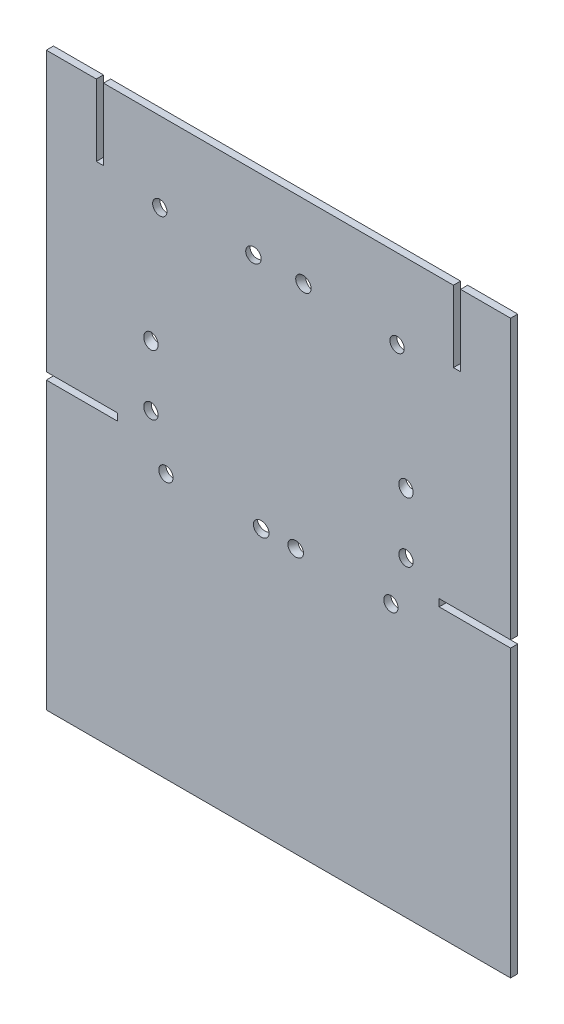
ISO-10303-21;
HEADER;
FILE_DESCRIPTION(('STEP AP214'),'2;1');
FILE_NAME('part.step','',(''),(''),'','','');
FILE_SCHEMA(('AUTOMOTIVE_DESIGN { 1 0 10303 214 1 1 1 1 }'));
ENDSEC;
DATA;
#1=APPLICATION_CONTEXT('core data for automotive mechanical design processes');
#2=APPLICATION_PROTOCOL_DEFINITION('international standard','automotive_design',2000,#1);
#3=PRODUCT_CONTEXT('',#1,'mechanical');
#4=PRODUCT('Part','Part','',(#3));
#5=PRODUCT_RELATED_PRODUCT_CATEGORY('part','',(#4));
#6=PRODUCT_DEFINITION_FORMATION('','',#4);
#7=PRODUCT_DEFINITION_CONTEXT('part definition',#1,'design');
#8=PRODUCT_DEFINITION('design','',#6,#7);
#9=PRODUCT_DEFINITION_SHAPE('','',#8);
#10=(LENGTH_UNIT() NAMED_UNIT(*) SI_UNIT(.MILLI.,.METRE.));
#11=(NAMED_UNIT(*) PLANE_ANGLE_UNIT() SI_UNIT($,.RADIAN.));
#12=(NAMED_UNIT(*) SI_UNIT($,.STERADIAN.) SOLID_ANGLE_UNIT());
#13=UNCERTAINTY_MEASURE_WITH_UNIT(LENGTH_MEASURE(1.E-05),#10,'distance_accuracy_value','');
#14=(GEOMETRIC_REPRESENTATION_CONTEXT(3) GLOBAL_UNCERTAINTY_ASSIGNED_CONTEXT((#13)) GLOBAL_UNIT_ASSIGNED_CONTEXT((#10,
#11,#12)) REPRESENTATION_CONTEXT('',''));
#15=CARTESIAN_POINT('',(0.,0.,0.));
#16=DIRECTION('',(0.,0.,1.));
#17=DIRECTION('',(1.,0.,0.));
#18=AXIS2_PLACEMENT_3D('',#15,#16,#17);
#19=CARTESIAN_POINT('',(-412.75,508.,6.35));
#20=DIRECTION('',(0.,-1.,0.));
#21=DIRECTION('',(1.,0.,0.));
#22=AXIS2_PLACEMENT_3D('',#19,#20,#21);
#23=PLANE('',#22);
#24=DIRECTION('',(-1.,0.,0.));
#25=VECTOR('',#24,1.);
#26=CARTESIAN_POINT('',(-412.75,508.,-6.35));
#27=LINE('',#26,#25);
#28=CARTESIAN_POINT('',(311.150000000003,507.999999999998,-6.35));
#29=VERTEX_POINT('',#28);
#30=CARTESIAN_POINT('',(-311.15,508.,-6.35));
#31=VERTEX_POINT('',#30);
#32=EDGE_CURVE('E349',#29,#31,#27,.T.);
#33=ORIENTED_EDGE('',*,*,#32,.T.);
#34=DIRECTION('',(0.,0.,-1.));
#35=VECTOR('',#34,1.);
#36=CARTESIAN_POINT('',(-311.15,508.,6.35000000000002));
#37=LINE('',#36,#35);
#38=CARTESIAN_POINT('',(-311.15,508.,6.35000000000002));
#39=VERTEX_POINT('',#38);
#40=EDGE_CURVE('E211',#39,#31,#37,.T.);
#41=ORIENTED_EDGE('',*,*,#40,.F.);
#42=DIRECTION('',(-1.,0.,0.));
#43=VECTOR('',#42,1.);
#44=CARTESIAN_POINT('',(-412.75,508.,6.35));
#45=LINE('',#44,#43);
#46=CARTESIAN_POINT('',(311.150000000003,507.999999999998,6.35000000000002));
#47=VERTEX_POINT('',#46);
#48=EDGE_CURVE('E202',#47,#39,#45,.T.);
#49=ORIENTED_EDGE('',*,*,#48,.F.);
#50=DIRECTION('',(0.,0.,-1.));
#51=VECTOR('',#50,1.);
#52=CARTESIAN_POINT('',(311.150000000003,507.999999999998,6.35000000000002));
#53=LINE('',#52,#51);
#54=EDGE_CURVE('E217',#47,#29,#53,.T.);
#55=ORIENTED_EDGE('',*,*,#54,.T.);
#56=EDGE_LOOP('',(#33,#41,#49,#55));
#57=FACE_BOUND('',#56,.T.);
#58=ADVANCED_FACE('F39',(#57),#23,.F.);
#59=CARTESIAN_POINT('',(-323.85,508.,6.35000000000002));
#60=VERTEX_POINT('',#59);
#61=CARTESIAN_POINT('',(-412.75,508.,6.35));
#62=VERTEX_POINT('',#61);
#63=EDGE_CURVE('E360',#60,#62,#45,.T.);
#64=ORIENTED_EDGE('',*,*,#63,.F.);
#65=DIRECTION('',(0.,0.,-1.));
#66=VECTOR('',#65,1.);
#67=CARTESIAN_POINT('',(-323.85,508.,6.35000000000002));
#68=LINE('',#67,#66);
#69=CARTESIAN_POINT('',(-323.85,508.,-6.35));
#70=VERTEX_POINT('',#69);
#71=EDGE_CURVE('E214',#60,#70,#68,.T.);
#72=ORIENTED_EDGE('',*,*,#71,.T.);
#73=CARTESIAN_POINT('',(-412.75,508.,-6.35));
#74=VERTEX_POINT('',#73);
#75=EDGE_CURVE('E342',#70,#74,#27,.T.);
#76=ORIENTED_EDGE('',*,*,#75,.T.);
#77=DIRECTION('',(0.,0.,-1.));
#78=VECTOR('',#77,1.);
#79=CARTESIAN_POINT('',(-412.75,508.,6.35));
#80=LINE('',#79,#78);
#81=EDGE_CURVE('E331',#62,#74,#80,.T.);
#82=ORIENTED_EDGE('',*,*,#81,.F.);
#83=EDGE_LOOP('',(#64,#72,#76,#82));
#84=FACE_BOUND('',#83,.T.);
#85=ADVANCED_FACE('F489',(#84),#23,.F.);
#86=CARTESIAN_POINT('',(412.75,508.,6.35));
#87=DIRECTION('',(-1.,0.,0.));
#88=DIRECTION('',(0.,-1.,0.));
#89=AXIS2_PLACEMENT_3D('',#86,#87,#88);
#90=PLANE('',#89);
#91=DIRECTION('',(0.,0.,-1.));
#92=VECTOR('',#91,1.);
#93=CARTESIAN_POINT('',(412.75,12.6999999999955,6.35000000000002));
#94=LINE('',#93,#92);
#95=CARTESIAN_POINT('',(412.75,12.6999999999955,6.35000000000002));
#96=VERTEX_POINT('',#95);
#97=CARTESIAN_POINT('',(412.75,12.6999999999955,-6.35));
#98=VERTEX_POINT('',#97);
#99=EDGE_CURVE('E213',#96,#98,#94,.T.);
#100=ORIENTED_EDGE('',*,*,#99,.T.);
#101=DIRECTION('',(0.,1.,0.));
#102=VECTOR('',#101,1.);
#103=CARTESIAN_POINT('',(412.75,508.,-6.35));
#104=LINE('',#103,#102);
#105=CARTESIAN_POINT('',(412.75,508.,-6.35));
#106=VERTEX_POINT('',#105);
#107=EDGE_CURVE('E266',#98,#106,#104,.T.);
#108=ORIENTED_EDGE('',*,*,#107,.T.);
#109=DIRECTION('',(0.,0.,-1.));
#110=VECTOR('',#109,1.);
#111=CARTESIAN_POINT('',(412.75,508.,6.35));
#112=LINE('',#111,#110);
#113=CARTESIAN_POINT('',(412.75,508.,6.35));
#114=VERTEX_POINT('',#113);
#115=EDGE_CURVE('E326',#114,#106,#112,.T.);
#116=ORIENTED_EDGE('',*,*,#115,.F.);
#117=DIRECTION('',(0.,1.,0.));
#118=VECTOR('',#117,1.);
#119=CARTESIAN_POINT('',(412.75,508.,6.35));
#120=LINE('',#119,#118);
#121=EDGE_CURVE('E364',#96,#114,#120,.T.);
#122=ORIENTED_EDGE('',*,*,#121,.F.);
#123=EDGE_LOOP('',(#100,#108,#116,#122));
#124=FACE_BOUND('',#123,.T.);
#125=ADVANCED_FACE('F448',(#124),#90,.F.);
#126=CARTESIAN_POINT('',(-412.75,508.,6.35));
#127=DIRECTION('',(1.,0.,0.));
#128=DIRECTION('',(0.,1.,0.));
#129=AXIS2_PLACEMENT_3D('',#126,#127,#128);
#130=PLANE('',#129);
#131=DIRECTION('',(0.,0.,-1.));
#132=VECTOR('',#131,1.);
#133=CARTESIAN_POINT('',(-412.75,2.22044604925031E-13,6.35000000000002));
#134=LINE('',#133,#132);
#135=CARTESIAN_POINT('',(-412.75,2.22044604925031E-13,6.35000000000002));
#136=VERTEX_POINT('',#135);
#137=CARTESIAN_POINT('',(-412.75,2.22044604925031E-13,-6.35));
#138=VERTEX_POINT('',#137);
#139=EDGE_CURVE('E263',#136,#138,#134,.T.);
#140=ORIENTED_EDGE('',*,*,#139,.T.);
#141=DIRECTION('',(0.,-1.,0.));
#142=VECTOR('',#141,1.);
#143=CARTESIAN_POINT('',(-412.75,508.,-6.35));
#144=LINE('',#143,#142);
#145=CARTESIAN_POINT('',(-412.75,-508.,-6.35));
#146=VERTEX_POINT('',#145);
#147=EDGE_CURVE('E329',#138,#146,#144,.T.);
#148=ORIENTED_EDGE('',*,*,#147,.T.);
#149=DIRECTION('',(0.,0.,-1.));
#150=VECTOR('',#149,1.);
#151=CARTESIAN_POINT('',(-412.75,-508.,6.35));
#152=LINE('',#151,#150);
#153=CARTESIAN_POINT('',(-412.75,-508.,6.35));
#154=VERTEX_POINT('',#153);
#155=EDGE_CURVE('E336',#154,#146,#152,.T.);
#156=ORIENTED_EDGE('',*,*,#155,.F.);
#157=DIRECTION('',(0.,-1.,0.));
#158=VECTOR('',#157,1.);
#159=CARTESIAN_POINT('',(-412.75,508.,6.35));
#160=LINE('',#159,#158);
#161=EDGE_CURVE('E356',#136,#154,#160,.T.);
#162=ORIENTED_EDGE('',*,*,#161,.F.);
#163=EDGE_LOOP('',(#140,#148,#156,#162));
#164=FACE_BOUND('',#163,.T.);
#165=ADVANCED_FACE('F474',(#164),#130,.F.);
#166=CARTESIAN_POINT('',(0.,0.,6.35));
#167=DIRECTION('',(0.,0.,1.));
#168=DIRECTION('',(1.,0.,0.));
#169=AXIS2_PLACEMENT_3D('',#166,#167,#168);
#170=PLANE('',#169);
#171=DIRECTION('',(0.,-1.,0.));
#172=VECTOR('',#171,1.);
#173=CARTESIAN_POINT('',(-311.15,508.,6.35000000000002));
#174=LINE('',#173,#172);
#175=CARTESIAN_POINT('',(-311.15,381.,6.35000000000002));
#176=VERTEX_POINT('',#175);
#177=EDGE_CURVE('E181',#39,#176,#174,.T.);
#178=ORIENTED_EDGE('',*,*,#177,.T.);
#179=DIRECTION('',(-1.,0.,0.));
#180=VECTOR('',#179,1.);
#181=CARTESIAN_POINT('',(-311.15,381.,6.35000000000002));
#182=LINE('',#181,#180);
#183=CARTESIAN_POINT('',(-323.85,381.,6.35000000000002));
#184=VERTEX_POINT('',#183);
#185=EDGE_CURVE('E192',#176,#184,#182,.T.);
#186=ORIENTED_EDGE('',*,*,#185,.T.);
#187=DIRECTION('',(0.,1.,0.));
#188=VECTOR('',#187,1.);
#189=CARTESIAN_POINT('',(-323.85,508.,6.35000000000002));
#190=LINE('',#189,#188);
#191=EDGE_CURVE('E189',#184,#60,#190,.T.);
#192=ORIENTED_EDGE('',*,*,#191,.T.);
#193=ORIENTED_EDGE('',*,*,#63,.T.);
#194=CARTESIAN_POINT('',(-412.75,12.6999999999982,6.35000000000002));
#195=VERTEX_POINT('',#194);
#196=EDGE_CURVE('E353',#62,#195,#160,.T.);
#197=ORIENTED_EDGE('',*,*,#196,.T.);
#198=DIRECTION('',(1.,0.,0.));
#199=VECTOR('',#198,1.);
#200=CARTESIAN_POINT('',(-412.75,12.6999999999982,6.35000000000002));
#201=LINE('',#200,#199);
#202=CARTESIAN_POINT('',(-285.75,12.6999999999982,6.35000000000002));
#203=VERTEX_POINT('',#202);
#204=EDGE_CURVE('E245',#195,#203,#201,.T.);
#205=ORIENTED_EDGE('',*,*,#204,.T.);
#206=DIRECTION('',(0.,-1.,0.));
#207=VECTOR('',#206,1.);
#208=CARTESIAN_POINT('',(-285.75,12.6999999999982,6.35000000000002));
#209=LINE('',#208,#207);
#210=CARTESIAN_POINT('',(-285.75,0.,6.35000000000002));
#211=VERTEX_POINT('',#210);
#212=EDGE_CURVE('E241',#203,#211,#209,.T.);
#213=ORIENTED_EDGE('',*,*,#212,.T.);
#214=DIRECTION('',(1.,0.,0.));
#215=VECTOR('',#214,1.);
#216=CARTESIAN_POINT('',(-412.75,2.22044604925031E-13,6.35000000000002));
#217=LINE('',#216,#215);
#218=EDGE_CURVE('E239',#136,#211,#217,.T.);
#219=ORIENTED_EDGE('',*,*,#218,.F.);
#220=ORIENTED_EDGE('',*,*,#161,.T.);
#221=DIRECTION('',(1.,0.,0.));
#222=VECTOR('',#221,1.);
#223=CARTESIAN_POINT('',(-412.75,-508.,6.35));
#224=LINE('',#223,#222);
#225=CARTESIAN_POINT('',(412.75,-508.,6.35));
#226=VERTEX_POINT('',#225);
#227=EDGE_CURVE('E325',#154,#226,#224,.T.);
#228=ORIENTED_EDGE('',*,*,#227,.T.);
#229=CARTESIAN_POINT('',(412.75,-2.66453525910038E-12,6.35000000000002));
#230=VERTEX_POINT('',#229);
#231=EDGE_CURVE('E361',#226,#230,#120,.T.);
#232=ORIENTED_EDGE('',*,*,#231,.T.);
#233=DIRECTION('',(-1.,0.,0.));
#234=VECTOR('',#233,1.);
#235=CARTESIAN_POINT('',(412.75,-2.66453525910038E-12,6.35000000000002));
#236=LINE('',#235,#234);
#237=CARTESIAN_POINT('',(285.75,-2.01395445867445E-12,6.35000000000002));
#238=VERTEX_POINT('',#237);
#239=EDGE_CURVE('E280',#230,#238,#236,.T.);
#240=ORIENTED_EDGE('',*,*,#239,.T.);
#241=DIRECTION('',(0.,-1.,0.));
#242=VECTOR('',#241,1.);
#243=CARTESIAN_POINT('',(285.75,12.6999999999964,6.35000000000002));
#244=LINE('',#243,#242);
#245=CARTESIAN_POINT('',(285.75,12.6999999999964,6.35000000000002));
#246=VERTEX_POINT('',#245);
#247=EDGE_CURVE('E286',#246,#238,#244,.T.);
#248=ORIENTED_EDGE('',*,*,#247,.F.);
#249=DIRECTION('',(-1.,0.,0.));
#250=VECTOR('',#249,1.);
#251=CARTESIAN_POINT('',(412.75,12.6999999999955,6.35000000000002));
#252=LINE('',#251,#250);
#253=EDGE_CURVE('E269',#96,#246,#252,.T.);
#254=ORIENTED_EDGE('',*,*,#253,.F.);
#255=ORIENTED_EDGE('',*,*,#121,.T.);
#256=CARTESIAN_POINT('',(323.850000000003,508.,6.35));
#257=VERTEX_POINT('',#256);
#258=EDGE_CURVE('E357',#114,#257,#45,.T.);
#259=ORIENTED_EDGE('',*,*,#258,.T.);
#260=DIRECTION('',(0.,-1.,0.));
#261=VECTOR('',#260,1.);
#262=CARTESIAN_POINT('',(323.850000000003,507.999999999998,6.35000000000002));
#263=LINE('',#262,#261);
#264=CARTESIAN_POINT('',(323.850000000003,380.999999999998,6.35000000000002));
#265=VERTEX_POINT('',#264);
#266=EDGE_CURVE('E56',#257,#265,#263,.T.);
#267=ORIENTED_EDGE('',*,*,#266,.T.);
#268=DIRECTION('',(-1.,0.,0.));
#269=VECTOR('',#268,1.);
#270=CARTESIAN_POINT('',(311.150000000003,380.999999999998,6.35000000000002));
#271=LINE('',#270,#269);
#272=CARTESIAN_POINT('',(311.150000000003,380.999999999998,6.35000000000002));
#273=VERTEX_POINT('',#272);
#274=EDGE_CURVE('E220',#265,#273,#271,.T.);
#275=ORIENTED_EDGE('',*,*,#274,.T.);
#276=DIRECTION('',(0.,1.,0.));
#277=VECTOR('',#276,1.);
#278=CARTESIAN_POINT('',(311.150000000003,507.999999999998,6.35000000000002));
#279=LINE('',#278,#277);
#280=EDGE_CURVE('E231',#273,#47,#279,.T.);
#281=ORIENTED_EDGE('',*,*,#280,.T.);
#282=ORIENTED_EDGE('',*,*,#48,.T.);
#283=EDGE_LOOP('',(#178,#186,#192,#193,#197,#205,#213,#219,#220,#228,#232,#240,#248,#254,#255,
#259,#267,#275,#281,#282));
#284=FACE_BOUND('',#283,.T.);
#285=CARTESIAN_POINT('',(-200.,-38.0999999999997,6.34999999999997));
#286=DIRECTION('',(0.,0.,1.));
#287=DIRECTION('',(1.,0.,0.));
#288=AXIS2_PLACEMENT_3D('',#285,#286,#287);
#289=CIRCLE('',#288,12.7);
#290=CARTESIAN_POINT('',(-187.3,-38.0999999999997,6.34999999999997));
#291=VERTEX_POINT('',#290);
#292=EDGE_CURVE('E43',#291,#291,#289,.F.);
#293=ORIENTED_EDGE('',*,*,#292,.T.);
#294=EDGE_LOOP('',(#293));
#295=FACE_BOUND('',#294,.T.);
#296=CARTESIAN_POINT('',(-226.738278646609,45.742927735187,6.35000000000002));
#297=DIRECTION('',(0.,0.,1.));
#298=DIRECTION('',(-0.303832853142546,0.95272535252887,0.));
#299=AXIS2_PLACEMENT_3D('',#296,#297,#298);
#300=ELLIPSE('',#299,13.0343806943275,12.7);
#301=CARTESIAN_POINT('',(-230.698551721913,58.1611126771857,6.35000000000002));
#302=VERTEX_POINT('',#301);
#303=EDGE_CURVE('E303',#302,#302,#300,.F.);
#304=ORIENTED_EDGE('',*,*,#303,.T.);
#305=EDGE_LOOP('',(#304));
#306=FACE_BOUND('',#305,.T.);
#307=CARTESIAN_POINT('',(200.000000000002,-38.0999999999998,6.35000000000002));
#308=DIRECTION('',(0.,0.,1.));
#309=DIRECTION('',(1.,0.,0.));
#310=AXIS2_PLACEMENT_3D('',#307,#308,#309);
#311=CIRCLE('',#310,12.7);
#312=CARTESIAN_POINT('',(212.700000000002,-38.0999999999998,6.35000000000002));
#313=VERTEX_POINT('',#312);
#314=EDGE_CURVE('E300',#313,#313,#311,.F.);
#315=ORIENTED_EDGE('',*,*,#314,.T.);
#316=EDGE_LOOP('',(#315));
#317=FACE_BOUND('',#316,.T.);
#318=CARTESIAN_POINT('',(226.738278646599,45.742927735198,6.35000000000002));
#319=DIRECTION('',(0.,0.,1.));
#320=DIRECTION('',(0.303832853142368,0.952725352528927,0.));
#321=AXIS2_PLACEMENT_3D('',#318,#319,#320);
#322=ELLIPSE('',#321,13.0343806943275,12.7);
#323=CARTESIAN_POINT('',(230.6985517219,58.1611126771975,6.35000000000002));
#324=VERTEX_POINT('',#323);
#325=EDGE_CURVE('E297',#324,#324,#322,.F.);
#326=ORIENTED_EDGE('',*,*,#325,.T.);
#327=EDGE_LOOP('',(#326));
#328=FACE_BOUND('',#327,.T.);
#329=CARTESIAN_POINT('',(210.931171426476,366.455479351303,6.35000000000002));
#330=DIRECTION('',(0.,0.,1.));
#331=DIRECTION('',(0.196463058124641,0.980511227264795,0.));
#332=AXIS2_PLACEMENT_3D('',#329,#330,#331);
#333=ELLIPSE('',#332,12.8347094862159,12.7);
#334=CARTESIAN_POINT('',(213.452717702279,379.04005610122,6.35000000000002));
#335=VERTEX_POINT('',#334);
#336=EDGE_CURVE('E294',#335,#335,#333,.F.);
#337=ORIENTED_EDGE('',*,*,#336,.T.);
#338=EDGE_LOOP('',(#337));
#339=FACE_BOUND('',#338,.T.);
#340=CARTESIAN_POINT('',(-210.931171426473,366.455479351302,6.34999999999997));
#341=DIRECTION('',(0.,0.,1.));
#342=DIRECTION('',(0.19646305812471,-0.980511227264781,0.));
#343=AXIS2_PLACEMENT_3D('',#340,#341,#342);
#344=ELLIPSE('',#343,12.8347094862159,12.7);
#345=CARTESIAN_POINT('',(-208.409625150669,353.870902601385,6.34999999999997));
#346=VERTEX_POINT('',#345);
#347=EDGE_CURVE('E290',#346,#346,#344,.F.);
#348=ORIENTED_EDGE('',*,*,#347,.T.);
#349=EDGE_LOOP('',(#348));
#350=FACE_BOUND('',#349,.T.);
#351=CARTESIAN_POINT('',(226.738278646599,153.183977553133,6.35000000000002));
#352=DIRECTION('',(0.,0.,1.));
#353=DIRECTION('',(0.166125263951469,-0.98610465807492,0.));
#354=AXIS2_PLACEMENT_3D('',#351,#352,#353);
#355=ELLIPSE('',#354,13.7867372389529,12.7);
#356=CARTESIAN_POINT('',(229.028604009449,139.588811742146,6.35000000000002));
#357=VERTEX_POINT('',#356);
#358=EDGE_CURVE('E293',#357,#357,#355,.F.);
#359=ORIENTED_EDGE('',*,*,#358,.T.);
#360=EDGE_LOOP('',(#359));
#361=FACE_BOUND('',#360,.T.);
#362=CARTESIAN_POINT('',(-226.738278646608,153.183977553121,6.35000000000002));
#363=DIRECTION('',(0.,0.,1.));
#364=DIRECTION('',(-0.166125263951556,-0.986104658074905,0.));
#365=AXIS2_PLACEMENT_3D('',#362,#363,#364);
#366=ELLIPSE('',#365,13.7867372389531,12.7);
#367=CARTESIAN_POINT('',(-229.02860400946,139.588811742135,6.35000000000002));
#368=VERTEX_POINT('',#367);
#369=EDGE_CURVE('E367',#368,#368,#366,.F.);
#370=ORIENTED_EDGE('',*,*,#369,.T.);
#371=EDGE_LOOP('',(#370));
#372=FACE_BOUND('',#371,.T.);
#373=CARTESIAN_POINT('',(-44.4461666666638,376.690974591494,6.35000000000002));
#374=DIRECTION('',(0.,0.,1.));
#375=DIRECTION('',(0.923125632822931,0.384498460367872,0.));
#376=AXIS2_PLACEMENT_3D('',#373,#374,#375);
#377=ELLIPSE('',#376,13.8866788867449,12.7);
#378=CARTESIAN_POINT('',(-31.6270174315286,382.03038124307,6.35000000000002));
#379=VERTEX_POINT('',#378);
#380=EDGE_CURVE('E370',#379,#379,#377,.F.);
#381=ORIENTED_EDGE('',*,*,#380,.T.);
#382=EDGE_LOOP('',(#381));
#383=FACE_BOUND('',#382,.T.);
#384=CARTESIAN_POINT('',(44.446166666669,376.690974591494,6.34999999999997));
#385=DIRECTION('',(0.,0.,1.));
#386=DIRECTION('',(0.923125632822932,-0.384498460367868,0.));
#387=AXIS2_PLACEMENT_3D('',#384,#385,#386);
#388=ELLIPSE('',#387,13.8866788867449,12.7);
#389=CARTESIAN_POINT('',(57.2653159018043,371.351567939917,6.34999999999997));
#390=VERTEX_POINT('',#389);
#391=EDGE_CURVE('E373',#390,#390,#388,.F.);
#392=ORIENTED_EDGE('',*,*,#391,.T.);
#393=EDGE_LOOP('',(#392));
#394=FACE_BOUND('',#393,.T.);
#395=CARTESIAN_POINT('',(-30.6666666666667,-38.0999999999998,6.35000000000002));
#396=DIRECTION('',(0.,0.,1.));
#397=DIRECTION('',(1.,0.,0.));
#398=AXIS2_PLACEMENT_3D('',#395,#396,#397);
#399=ELLIPSE('',#398,13.8978326758678,12.7);
#400=CARTESIAN_POINT('',(-16.7688339907989,-38.0999999999998,6.35000000000002));
#401=VERTEX_POINT('',#400);
#402=EDGE_CURVE('E376',#401,#401,#399,.F.);
#403=ORIENTED_EDGE('',*,*,#402,.T.);
#404=EDGE_LOOP('',(#403));
#405=FACE_BOUND('',#404,.T.);
#406=CARTESIAN_POINT('',(30.6666666666675,-38.0999999999997,6.34999999999997));
#407=DIRECTION('',(0.,0.,1.));
#408=DIRECTION('',(1.,0.,0.));
#409=AXIS2_PLACEMENT_3D('',#406,#407,#408);
#410=ELLIPSE('',#409,13.8978326758679,12.7);
#411=CARTESIAN_POINT('',(44.5644993425353,-38.0999999999997,6.34999999999997));
#412=VERTEX_POINT('',#411);
#413=EDGE_CURVE('E379',#412,#412,#410,.F.);
#414=ORIENTED_EDGE('',*,*,#413,.T.);
#415=EDGE_LOOP('',(#414));
#416=FACE_BOUND('',#415,.T.);
#417=ADVANCED_FACE('F41',(#284,#295,#306,#317,#328,#339,#350,#361,#372,#383,#394,#405,#416),
#170,.T.);
#418=CARTESIAN_POINT('',(0.,0.,-6.35));
#419=DIRECTION('',(0.,0.,1.));
#420=DIRECTION('',(1.,0.,0.));
#421=AXIS2_PLACEMENT_3D('',#418,#419,#420);
#422=PLANE('',#421);
#423=CARTESIAN_POINT('',(-200.,-38.0999999999997,-6.34999999999997));
#424=DIRECTION('',(0.,0.,1.));
#425=DIRECTION('',(1.,0.,0.));
#426=AXIS2_PLACEMENT_3D('',#423,#424,#425);
#427=CIRCLE('',#426,12.7);
#428=CARTESIAN_POINT('',(-187.3,-38.0999999999997,-6.34999999999997));
#429=VERTEX_POINT('',#428);
#430=EDGE_CURVE('E11',#429,#429,#427,.F.);
#431=ORIENTED_EDGE('',*,*,#430,.F.);
#432=EDGE_LOOP('',(#431));
#433=FACE_BOUND('',#432,.T.);
#434=CARTESIAN_POINT('',(-225.847002691722,42.9481634773474,-6.35000000000002));
#435=DIRECTION('',(0.,0.,1.));
#436=DIRECTION('',(-0.303832853142546,0.95272535252887,0.));
#437=AXIS2_PLACEMENT_3D('',#434,#435,#436);
#438=ELLIPSE('',#437,13.0343806943275,12.7);
#439=CARTESIAN_POINT('',(-229.807275767026,55.3663484193461,-6.35000000000002));
#440=VERTEX_POINT('',#439);
#441=EDGE_CURVE('E48',#440,#440,#438,.F.);
#442=ORIENTED_EDGE('',*,*,#441,.F.);
#443=EDGE_LOOP('',(#442));
#444=FACE_BOUND('',#443,.T.);
#445=CARTESIAN_POINT('',(200.000000000002,-38.0999999999998,-6.35000000000002));
#446=DIRECTION('',(0.,0.,1.));
#447=DIRECTION('',(1.,0.,0.));
#448=AXIS2_PLACEMENT_3D('',#445,#446,#447);
#449=CIRCLE('',#448,12.7);
#450=CARTESIAN_POINT('',(212.700000000002,-38.0999999999998,-6.35000000000002));
#451=VERTEX_POINT('',#450);
#452=EDGE_CURVE('E390',#451,#451,#449,.F.);
#453=ORIENTED_EDGE('',*,*,#452,.F.);
#454=EDGE_LOOP('',(#453));
#455=FACE_BOUND('',#454,.T.);
#456=CARTESIAN_POINT('',(225.847002691712,42.9481634773581,-6.35000000000002));
#457=DIRECTION('',(0.,0.,1.));
#458=DIRECTION('',(0.303832853142368,0.952725352528927,0.));
#459=AXIS2_PLACEMENT_3D('',#456,#457,#458);
#460=ELLIPSE('',#459,13.0343806943275,12.7);
#461=CARTESIAN_POINT('',(229.807275767014,55.3663484193575,-6.35000000000002));
#462=VERTEX_POINT('',#461);
#463=EDGE_CURVE('E387',#462,#462,#460,.F.);
#464=ORIENTED_EDGE('',*,*,#463,.F.);
#465=EDGE_LOOP('',(#464));
#466=FACE_BOUND('',#465,.T.);
#467=CARTESIAN_POINT('',(210.566799045594,364.636963372926,-6.35000000000002));
#468=DIRECTION('',(0.,0.,1.));
#469=DIRECTION('',(0.196463058124641,0.980511227264795,0.));
#470=AXIS2_PLACEMENT_3D('',#467,#468,#469);
#471=ELLIPSE('',#470,12.8347094862159,12.7);
#472=CARTESIAN_POINT('',(213.088345321397,377.221540122843,-6.35000000000002));
#473=VERTEX_POINT('',#472);
#474=EDGE_CURVE('E384',#473,#473,#471,.F.);
#475=ORIENTED_EDGE('',*,*,#474,.F.);
#476=EDGE_LOOP('',(#475));
#477=FACE_BOUND('',#476,.T.);
#478=CARTESIAN_POINT('',(-210.56679904559,364.636963372925,-6.34999999999997));
#479=DIRECTION('',(0.,0.,1.));
#480=DIRECTION('',(0.19646305812471,-0.980511227264781,0.));
#481=AXIS2_PLACEMENT_3D('',#478,#479,#480);
#482=ELLIPSE('',#481,12.8347094862159,12.7);
#483=CARTESIAN_POINT('',(-208.045252769786,352.052386623009,-6.34999999999997));
#484=VERTEX_POINT('',#483);
#485=EDGE_CURVE('E309',#484,#484,#482,.F.);
#486=ORIENTED_EDGE('',*,*,#485,.F.);
#487=EDGE_LOOP('',(#486));
#488=FACE_BOUND('',#487,.T.);
#489=CARTESIAN_POINT('',(225.847002691712,158.474511634695,-6.35000000000002));
#490=DIRECTION('',(0.,0.,1.));
#491=DIRECTION('',(0.166125263951469,-0.98610465807492,0.));
#492=AXIS2_PLACEMENT_3D('',#489,#490,#491);
#493=ELLIPSE('',#492,13.7867372389529,12.7);
#494=CARTESIAN_POINT('',(228.137328054563,144.879345823708,-6.35000000000002));
#495=VERTEX_POINT('',#494);
#496=EDGE_CURVE('E306',#495,#495,#493,.F.);
#497=ORIENTED_EDGE('',*,*,#496,.F.);
#498=EDGE_LOOP('',(#497));
#499=FACE_BOUND('',#498,.T.);
#500=CARTESIAN_POINT('',(-225.847002691721,158.474511634684,-6.35000000000002));
#501=DIRECTION('',(0.,0.,1.));
#502=DIRECTION('',(-0.166125263951556,-0.986104658074905,0.));
#503=AXIS2_PLACEMENT_3D('',#500,#501,#502);
#504=ELLIPSE('',#503,13.7867372389531,12.7);
#505=CARTESIAN_POINT('',(-228.137328054573,144.879345823697,-6.35000000000002));
#506=VERTEX_POINT('',#505);
#507=EDGE_CURVE('E310',#506,#506,#504,.F.);
#508=ORIENTED_EDGE('',*,*,#507,.F.);
#509=EDGE_LOOP('',(#508));
#510=FACE_BOUND('',#509,.T.);
#511=CARTESIAN_POINT('',(-49.6312944444416,374.531275438444,-6.35000000000002));
#512=DIRECTION('',(0.,0.,1.));
#513=DIRECTION('',(0.923125632822931,0.384498460367872,0.));
#514=AXIS2_PLACEMENT_3D('',#511,#512,#513);
#515=ELLIPSE('',#514,13.8866788867449,12.7);
#516=CARTESIAN_POINT('',(-36.8121452093064,379.87068209002,-6.35000000000002));
#517=VERTEX_POINT('',#516);
#518=EDGE_CURVE('E313',#517,#517,#515,.F.);
#519=ORIENTED_EDGE('',*,*,#518,.F.);
#520=EDGE_LOOP('',(#519));
#521=FACE_BOUND('',#520,.T.);
#522=CARTESIAN_POINT('',(49.6312944444468,374.531275438444,-6.34999999999997));
#523=DIRECTION('',(0.,0.,1.));
#524=DIRECTION('',(0.923125632822932,-0.384498460367868,0.));
#525=AXIS2_PLACEMENT_3D('',#522,#523,#524);
#526=ELLIPSE('',#525,13.8866788867449,12.7);
#527=CARTESIAN_POINT('',(62.4504436795821,369.191868786867,-6.34999999999997));
#528=VERTEX_POINT('',#527);
#529=EDGE_CURVE('E316',#528,#528,#526,.F.);
#530=ORIENTED_EDGE('',*,*,#529,.F.);
#531=EDGE_LOOP('',(#530));
#532=FACE_BOUND('',#531,.T.);
#533=CARTESIAN_POINT('',(-36.3111111111112,-38.0999999999998,-6.35000000000002));
#534=DIRECTION('',(0.,0.,1.));
#535=DIRECTION('',(1.,0.,0.));
#536=AXIS2_PLACEMENT_3D('',#533,#534,#535);
#537=ELLIPSE('',#536,13.8978326758678,12.7);
#538=CARTESIAN_POINT('',(-22.4132784352433,-38.0999999999998,-6.35000000000002));
#539=VERTEX_POINT('',#538);
#540=EDGE_CURVE('E319',#539,#539,#537,.F.);
#541=ORIENTED_EDGE('',*,*,#540,.F.);
#542=EDGE_LOOP('',(#541));
#543=FACE_BOUND('',#542,.T.);
#544=CARTESIAN_POINT('',(36.311111111112,-38.0999999999997,-6.34999999999997));
#545=DIRECTION('',(0.,0.,1.));
#546=DIRECTION('',(1.,0.,0.));
#547=AXIS2_PLACEMENT_3D('',#544,#545,#546);
#548=ELLIPSE('',#547,13.8978326758679,12.7);
#549=CARTESIAN_POINT('',(50.2089437869798,-38.0999999999997,-6.34999999999997));
#550=VERTEX_POINT('',#549);
#551=EDGE_CURVE('E322',#550,#550,#548,.F.);
#552=ORIENTED_EDGE('',*,*,#551,.F.);
#553=EDGE_LOOP('',(#552));
#554=FACE_BOUND('',#553,.T.);
#555=DIRECTION('',(-1.,0.,0.));
#556=VECTOR('',#555,1.);
#557=CARTESIAN_POINT('',(-311.15,381.,-6.35));
#558=LINE('',#557,#556);
#559=CARTESIAN_POINT('',(-311.15,381.,-6.35));
#560=VERTEX_POINT('',#559);
#561=CARTESIAN_POINT('',(-323.85,381.,-6.35));
#562=VERTEX_POINT('',#561);
#563=EDGE_CURVE('E204',#560,#562,#558,.T.);
#564=ORIENTED_EDGE('',*,*,#563,.F.);
#565=DIRECTION('',(0.,-1.,0.));
#566=VECTOR('',#565,1.);
#567=CARTESIAN_POINT('',(-311.15,508.,-6.35));
#568=LINE('',#567,#566);
#569=EDGE_CURVE('E184',#31,#560,#568,.T.);
#570=ORIENTED_EDGE('',*,*,#569,.F.);
#571=ORIENTED_EDGE('',*,*,#32,.F.);
#572=DIRECTION('',(0.,1.,0.));
#573=VECTOR('',#572,1.);
#574=CARTESIAN_POINT('',(311.150000000003,507.999999999998,-6.35));
#575=LINE('',#574,#573);
#576=CARTESIAN_POINT('',(311.150000000003,380.999999999998,-6.35));
#577=VERTEX_POINT('',#576);
#578=EDGE_CURVE('E209',#577,#29,#575,.T.);
#579=ORIENTED_EDGE('',*,*,#578,.F.);
#580=DIRECTION('',(-1.,0.,0.));
#581=VECTOR('',#580,1.);
#582=CARTESIAN_POINT('',(311.150000000003,380.999999999998,-6.35));
#583=LINE('',#582,#581);
#584=CARTESIAN_POINT('',(323.850000000003,380.999999999998,-6.35));
#585=VERTEX_POINT('',#584);
#586=EDGE_CURVE('E227',#585,#577,#583,.T.);
#587=ORIENTED_EDGE('',*,*,#586,.F.);
#588=DIRECTION('',(0.,-1.,0.));
#589=VECTOR('',#588,1.);
#590=CARTESIAN_POINT('',(323.850000000003,507.999999999998,-6.35));
#591=LINE('',#590,#589);
#592=CARTESIAN_POINT('',(323.850000000003,507.999999999998,-6.35));
#593=VERTEX_POINT('',#592);
#594=EDGE_CURVE('E230',#593,#585,#591,.T.);
#595=ORIENTED_EDGE('',*,*,#594,.F.);
#596=EDGE_CURVE('E330',#106,#593,#27,.T.);
#597=ORIENTED_EDGE('',*,*,#596,.F.);
#598=ORIENTED_EDGE('',*,*,#107,.F.);
#599=DIRECTION('',(-1.,0.,0.));
#600=VECTOR('',#599,1.);
#601=CARTESIAN_POINT('',(412.75,12.6999999999955,-6.35));
#602=LINE('',#601,#600);
#603=CARTESIAN_POINT('',(285.75,12.6999999999964,-6.35));
#604=VERTEX_POINT('',#603);
#605=EDGE_CURVE('E276',#98,#604,#602,.T.);
#606=ORIENTED_EDGE('',*,*,#605,.T.);
#607=DIRECTION('',(0.,-1.,0.));
#608=VECTOR('',#607,1.);
#609=CARTESIAN_POINT('',(285.75,12.6999999999964,-6.35));
#610=LINE('',#609,#608);
#611=CARTESIAN_POINT('',(285.75,-2.01395445867445E-12,-6.35));
#612=VERTEX_POINT('',#611);
#613=EDGE_CURVE('E279',#604,#612,#610,.T.);
#614=ORIENTED_EDGE('',*,*,#613,.T.);
#615=DIRECTION('',(-1.,0.,0.));
#616=VECTOR('',#615,1.);
#617=CARTESIAN_POINT('',(412.75,-2.66453525910038E-12,-6.35));
#618=LINE('',#617,#616);
#619=CARTESIAN_POINT('',(412.75,-2.33146835171283E-12,-6.35));
#620=VERTEX_POINT('',#619);
#621=EDGE_CURVE('E253',#620,#612,#618,.T.);
#622=ORIENTED_EDGE('',*,*,#621,.F.);
#623=CARTESIAN_POINT('',(412.75,-508.,-6.35));
#624=VERTEX_POINT('',#623);
#625=EDGE_CURVE('E343',#624,#620,#104,.T.);
#626=ORIENTED_EDGE('',*,*,#625,.F.);
#627=DIRECTION('',(1.,0.,0.));
#628=VECTOR('',#627,1.);
#629=CARTESIAN_POINT('',(-412.75,-508.,-6.35));
#630=LINE('',#629,#628);
#631=EDGE_CURVE('E334',#146,#624,#630,.T.);
#632=ORIENTED_EDGE('',*,*,#631,.F.);
#633=ORIENTED_EDGE('',*,*,#147,.F.);
#634=DIRECTION('',(1.,0.,0.));
#635=VECTOR('',#634,1.);
#636=CARTESIAN_POINT('',(-412.75,2.22044604925031E-13,-6.35));
#637=LINE('',#636,#635);
#638=CARTESIAN_POINT('',(-285.75,0.,-6.35));
#639=VERTEX_POINT('',#638);
#640=EDGE_CURVE('E249',#138,#639,#637,.T.);
#641=ORIENTED_EDGE('',*,*,#640,.T.);
#642=DIRECTION('',(0.,-1.,0.));
#643=VECTOR('',#642,1.);
#644=CARTESIAN_POINT('',(-285.75,12.6999999999982,-6.35));
#645=LINE('',#644,#643);
#646=CARTESIAN_POINT('',(-285.75,12.6999999999982,-6.35));
#647=VERTEX_POINT('',#646);
#648=EDGE_CURVE('E252',#647,#639,#645,.T.);
#649=ORIENTED_EDGE('',*,*,#648,.F.);
#650=DIRECTION('',(1.,0.,0.));
#651=VECTOR('',#650,1.);
#652=CARTESIAN_POINT('',(-412.75,12.6999999999982,-6.35));
#653=LINE('',#652,#651);
#654=CARTESIAN_POINT('',(-412.75,12.6999999999982,-6.35));
#655=VERTEX_POINT('',#654);
#656=EDGE_CURVE('E242',#655,#647,#653,.T.);
#657=ORIENTED_EDGE('',*,*,#656,.F.);
#658=EDGE_CURVE('E335',#74,#655,#144,.T.);
#659=ORIENTED_EDGE('',*,*,#658,.F.);
#660=ORIENTED_EDGE('',*,*,#75,.F.);
#661=DIRECTION('',(0.,1.,0.));
#662=VECTOR('',#661,1.);
#663=CARTESIAN_POINT('',(-323.85,508.,-6.35));
#664=LINE('',#663,#662);
#665=EDGE_CURVE('E64',#562,#70,#664,.T.);
#666=ORIENTED_EDGE('',*,*,#665,.F.);
#667=EDGE_LOOP('',(#564,#570,#571,#579,#587,#595,#597,#598,#606,#614,#622,#626,#632,#633,#641,
#649,#657,#659,#660,#666));
#668=FACE_BOUND('',#667,.T.);
#669=ADVANCED_FACE('F397',(#433,#444,#455,#466,#477,#488,#499,#510,#521,#532,#543,#554,#668),
#422,.F.);
#670=ORIENTED_EDGE('',*,*,#625,.T.);
#671=DIRECTION('',(0.,0.,-1.));
#672=VECTOR('',#671,1.);
#673=CARTESIAN_POINT('',(412.75,-2.66453525910038E-12,6.35000000000002));
#674=LINE('',#673,#672);
#675=EDGE_CURVE('E267',#230,#620,#674,.T.);
#676=ORIENTED_EDGE('',*,*,#675,.F.);
#677=ORIENTED_EDGE('',*,*,#231,.F.);
#678=DIRECTION('',(0.,0.,-1.));
#679=VECTOR('',#678,1.);
#680=CARTESIAN_POINT('',(412.75,-508.,6.35));
#681=LINE('',#680,#679);
#682=EDGE_CURVE('E339',#226,#624,#681,.T.);
#683=ORIENTED_EDGE('',*,*,#682,.T.);
#684=EDGE_LOOP('',(#670,#676,#677,#683));
#685=FACE_BOUND('',#684,.T.);
#686=ADVANCED_FACE('F400',(#685),#90,.F.);
#687=ORIENTED_EDGE('',*,*,#596,.T.);
#688=DIRECTION('',(0.,0.,-1.));
#689=VECTOR('',#688,1.);
#690=CARTESIAN_POINT('',(323.850000000003,507.999999999998,6.35000000000002));
#691=LINE('',#690,#689);
#692=EDGE_CURVE('E221',#257,#593,#691,.T.);
#693=ORIENTED_EDGE('',*,*,#692,.F.);
#694=ORIENTED_EDGE('',*,*,#258,.F.);
#695=ORIENTED_EDGE('',*,*,#115,.T.);
#696=EDGE_LOOP('',(#687,#693,#694,#695));
#697=FACE_BOUND('',#696,.T.);
#698=ADVANCED_FACE('F443',(#697),#23,.F.);
#699=ORIENTED_EDGE('',*,*,#658,.T.);
#700=DIRECTION('',(0.,0.,-1.));
#701=VECTOR('',#700,1.);
#702=CARTESIAN_POINT('',(-412.75,12.6999999999982,6.35000000000002));
#703=LINE('',#702,#701);
#704=EDGE_CURVE('E248',#195,#655,#703,.T.);
#705=ORIENTED_EDGE('',*,*,#704,.F.);
#706=ORIENTED_EDGE('',*,*,#196,.F.);
#707=ORIENTED_EDGE('',*,*,#81,.T.);
#708=EDGE_LOOP('',(#699,#705,#706,#707));
#709=FACE_BOUND('',#708,.T.);
#710=ADVANCED_FACE('F486',(#709),#130,.F.);
#711=CARTESIAN_POINT('',(-412.75,-508.,6.35));
#712=DIRECTION('',(0.,1.,0.));
#713=DIRECTION('',(0.,0.,1.));
#714=AXIS2_PLACEMENT_3D('',#711,#712,#713);
#715=PLANE('',#714);
#716=ORIENTED_EDGE('',*,*,#631,.T.);
#717=ORIENTED_EDGE('',*,*,#682,.F.);
#718=ORIENTED_EDGE('',*,*,#227,.F.);
#719=ORIENTED_EDGE('',*,*,#155,.T.);
#720=EDGE_LOOP('',(#716,#717,#718,#719));
#721=FACE_BOUND('',#720,.T.);
#722=ADVANCED_FACE('F469',(#721),#715,.F.);
#723=CARTESIAN_POINT('',(-200.,-38.0999999999995,525.349999999994));
#724=DIRECTION('',(0.406138466053453,0.,-0.913811548620255));
#725=DIRECTION('',(-0.913811548620255,0.,-0.406138466053453));
#726=AXIS2_PLACEMENT_3D('',#723,#724,#725);
#727=CYLINDRICAL_SURFACE('',#726,12.7);
#728=ORIENTED_EDGE('',*,*,#413,.F.);
#729=EDGE_LOOP('',(#728));
#730=FACE_BOUND('',#729,.T.);
#731=ORIENTED_EDGE('',*,*,#551,.T.);
#732=EDGE_LOOP('',(#731));
#733=FACE_BOUND('',#732,.T.);
#734=ADVANCED_FACE('F524',(#730,#733),#727,.F.);
#735=CARTESIAN_POINT('',(-200.,-38.0999999999998,-374.65));
#736=DIRECTION('',(0.406138466053447,0.,0.913811548620257));
#737=DIRECTION('',(0.913811548620257,0.,-0.406138466053448));
#738=AXIS2_PLACEMENT_3D('',#735,#736,#737);
#739=CYLINDRICAL_SURFACE('',#738,12.7);
#740=ORIENTED_EDGE('',*,*,#402,.F.);
#741=EDGE_LOOP('',(#740));
#742=FACE_BOUND('',#741,.T.);
#743=ORIENTED_EDGE('',*,*,#540,.T.);
#744=EDGE_LOOP('',(#743));
#745=FACE_BOUND('',#744,.T.);
#746=ADVANCED_FACE('F539',(#742,#745),#739,.F.);
#747=CARTESIAN_POINT('',(-167.449999999999,464.949546279118,525.35));
#748=DIRECTION('',(0.373388613653845,-0.155523085877016,-0.914545522624735));
#749=DIRECTION('',(-0.925810546583646,0.,-0.377987872602403));
#750=AXIS2_PLACEMENT_3D('',#747,#748,#749);
#751=CYLINDRICAL_SURFACE('',#750,12.7);
#752=ORIENTED_EDGE('',*,*,#391,.F.);
#753=EDGE_LOOP('',(#752));
#754=FACE_BOUND('',#753,.T.);
#755=ORIENTED_EDGE('',*,*,#529,.T.);
#756=EDGE_LOOP('',(#755));
#757=FACE_BOUND('',#756,.T.);
#758=ADVANCED_FACE('F537',(#754,#757),#751,.F.);
#759=CARTESIAN_POINT('',(-199.999999999996,311.9,-374.65));
#760=DIRECTION('',(0.373388613653842,0.155523085877017,0.914545522624737));
#761=DIRECTION('',(0.925810546583648,0.,-0.377987872602399));
#762=AXIS2_PLACEMENT_3D('',#759,#760,#761);
#763=CYLINDRICAL_SURFACE('',#762,12.7);
#764=ORIENTED_EDGE('',*,*,#380,.F.);
#765=EDGE_LOOP('',(#764));
#766=FACE_BOUND('',#765,.T.);
#767=ORIENTED_EDGE('',*,*,#518,.T.);
#768=EDGE_LOOP('',(#767));
#769=FACE_BOUND('',#768,.T.);
#770=ADVANCED_FACE('F529',(#766,#769),#763,.F.);
#771=CARTESIAN_POINT('',(-199.999999999996,311.9,-374.65));
#772=DIRECTION('',(-0.0646473447226405,-0.383740836563907,0.921175168561086));
#773=DIRECTION('',(0.,0.923106147349443,0.384545238854504));
#774=AXIS2_PLACEMENT_3D('',#771,#772,#773);
#775=CYLINDRICAL_SURFACE('',#774,12.7);
#776=ORIENTED_EDGE('',*,*,#369,.F.);
#777=EDGE_LOOP('',(#776));
#778=FACE_BOUND('',#777,.T.);
#779=ORIENTED_EDGE('',*,*,#507,.T.);
#780=EDGE_LOOP('',(#779));
#781=FACE_BOUND('',#780,.T.);
#782=ADVANCED_FACE('F525',(#778,#781),#775,.F.);
#783=CARTESIAN_POINT('',(200.000000000003,311.9,-374.65));
#784=DIRECTION('',(0.0646473447226019,-0.383740836563885,0.921175168561098));
#785=DIRECTION('',(0.,0.923106147349453,0.384545238854481));
#786=AXIS2_PLACEMENT_3D('',#783,#784,#785);
#787=CYLINDRICAL_SURFACE('',#786,12.7);
#788=ORIENTED_EDGE('',*,*,#358,.F.);
#789=EDGE_LOOP('',(#788));
#790=FACE_BOUND('',#789,.T.);
#791=ORIENTED_EDGE('',*,*,#496,.T.);
#792=EDGE_LOOP('',(#791));
#793=FACE_BOUND('',#792,.T.);
#794=ADVANCED_FACE('F528',(#790,#793),#787,.F.);
#795=CARTESIAN_POINT('',(-225.821664786949,440.771211066067,525.349999999999));
#796=DIRECTION('',(0.0283896087616065,-0.141687350253603,-0.989504282402292));
#797=DIRECTION('',(0.,-0.98990327892955,0.141744482659913));
#798=AXIS2_PLACEMENT_3D('',#795,#796,#797);
#799=CYLINDRICAL_SURFACE('',#798,12.7);
#800=ORIENTED_EDGE('',*,*,#347,.F.);
#801=EDGE_LOOP('',(#800));
#802=FACE_BOUND('',#801,.T.);
#803=ORIENTED_EDGE('',*,*,#485,.T.);
#804=EDGE_LOOP('',(#803));
#805=FACE_BOUND('',#804,.T.);
#806=ADVANCED_FACE('F533',(#802,#805),#799,.F.);
#807=CARTESIAN_POINT('',(200.000000000003,311.9,-374.65));
#808=DIRECTION('',(0.0283896087615967,0.141687350253606,0.989504282402292));
#809=DIRECTION('',(0.,0.989903278929549,-0.141744482659916));
#810=AXIS2_PLACEMENT_3D('',#807,#808,#809);
#811=CYLINDRICAL_SURFACE('',#810,12.7);
#812=ORIENTED_EDGE('',*,*,#336,.F.);
#813=EDGE_LOOP('',(#812));
#814=FACE_BOUND('',#813,.T.);
#815=ORIENTED_EDGE('',*,*,#474,.T.);
#816=EDGE_LOOP('',(#815));
#817=FACE_BOUND('',#816,.T.);
#818=ADVANCED_FACE('F595',(#814,#817),#811,.F.);
#819=CARTESIAN_POINT('',(200.000000000003,-38.0999999999998,-374.65));
#820=DIRECTION('',(0.0683788494281433,0.214414809831064,0.974346253790711));
#821=DIRECTION('',(0.,0.97663213226301,-0.214917840654067));
#822=AXIS2_PLACEMENT_3D('',#819,#820,#821);
#823=CYLINDRICAL_SURFACE('',#822,12.7);
#824=ORIENTED_EDGE('',*,*,#325,.F.);
#825=EDGE_LOOP('',(#824));
#826=FACE_BOUND('',#825,.T.);
#827=ORIENTED_EDGE('',*,*,#463,.T.);
#828=EDGE_LOOP('',(#827));
#829=FACE_BOUND('',#828,.T.);
#830=ADVANCED_FACE('F600',(#826,#829),#823,.F.);
#831=CARTESIAN_POINT('',(200.000000000003,-38.0999999999998,-374.65));
#832=DIRECTION('',(0.,0.,1.));
#833=DIRECTION('',(1.,0.,0.));
#834=AXIS2_PLACEMENT_3D('',#831,#832,#833);
#835=CYLINDRICAL_SURFACE('',#834,12.7);
#836=ORIENTED_EDGE('',*,*,#314,.F.);
#837=EDGE_LOOP('',(#836));
#838=FACE_BOUND('',#837,.T.);
#839=ORIENTED_EDGE('',*,*,#452,.T.);
#840=EDGE_LOOP('',(#839));
#841=FACE_BOUND('',#840,.T.);
#842=ADVANCED_FACE('F557',(#838,#841),#835,.F.);
#843=CARTESIAN_POINT('',(-200.,-38.0999999999998,-374.65));
#844=DIRECTION('',(-0.0683788494281789,0.214414809831036,0.974346253790714));
#845=DIRECTION('',(0.,0.976632132263016,-0.214917840654041));
#846=AXIS2_PLACEMENT_3D('',#843,#844,#845);
#847=CYLINDRICAL_SURFACE('',#846,12.7);
#848=ORIENTED_EDGE('',*,*,#303,.F.);
#849=EDGE_LOOP('',(#848));
#850=FACE_BOUND('',#849,.T.);
#851=ORIENTED_EDGE('',*,*,#441,.T.);
#852=EDGE_LOOP('',(#851));
#853=FACE_BOUND('',#852,.T.);
#854=ADVANCED_FACE('F395',(#850,#853),#847,.F.);
#855=CARTESIAN_POINT('',(-200.,-38.0999999999995,525.349999999994));
#856=DIRECTION('',(0.,0.,-1.));
#857=DIRECTION('',(0.,-1.,0.));
#858=AXIS2_PLACEMENT_3D('',#855,#856,#857);
#859=CYLINDRICAL_SURFACE('',#858,12.7);
#860=ORIENTED_EDGE('',*,*,#292,.F.);
#861=EDGE_LOOP('',(#860));
#862=FACE_BOUND('',#861,.T.);
#863=ORIENTED_EDGE('',*,*,#430,.T.);
#864=EDGE_LOOP('',(#863));
#865=FACE_BOUND('',#864,.T.);
#866=ADVANCED_FACE('F549',(#862,#865),#859,.F.);
#867=CARTESIAN_POINT('',(412.75,12.6999999999955,6.35000000000002));
#868=DIRECTION('',(0.,-1.,0.));
#869=DIRECTION('',(1.,0.,0.));
#870=AXIS2_PLACEMENT_3D('',#867,#868,#869);
#871=PLANE('',#870);
#872=ORIENTED_EDGE('',*,*,#605,.F.);
#873=ORIENTED_EDGE('',*,*,#99,.F.);
#874=ORIENTED_EDGE('',*,*,#253,.T.);
#875=DIRECTION('',(0.,0.,-1.));
#876=VECTOR('',#875,1.);
#877=CARTESIAN_POINT('',(285.75,12.6999999999964,6.35000000000002));
#878=LINE('',#877,#876);
#879=EDGE_CURVE('E272',#246,#604,#878,.T.);
#880=ORIENTED_EDGE('',*,*,#879,.T.);
#881=EDGE_LOOP('',(#872,#873,#874,#880));
#882=FACE_BOUND('',#881,.T.);
#883=ADVANCED_FACE('F452',(#882),#871,.T.);
#884=CARTESIAN_POINT('',(285.75,12.6999999999964,6.35000000000002));
#885=DIRECTION('',(1.,0.,0.));
#886=DIRECTION('',(0.,1.,0.));
#887=AXIS2_PLACEMENT_3D('',#884,#885,#886);
#888=PLANE('',#887);
#889=ORIENTED_EDGE('',*,*,#613,.F.);
#890=ORIENTED_EDGE('',*,*,#879,.F.);
#891=ORIENTED_EDGE('',*,*,#247,.T.);
#892=DIRECTION('',(0.,0.,-1.));
#893=VECTOR('',#892,1.);
#894=CARTESIAN_POINT('',(285.75,-2.01395445867445E-12,6.35000000000002));
#895=LINE('',#894,#893);
#896=EDGE_CURVE('E270',#238,#612,#895,.T.);
#897=ORIENTED_EDGE('',*,*,#896,.T.);
#898=EDGE_LOOP('',(#889,#890,#891,#897));
#899=FACE_BOUND('',#898,.T.);
#900=ADVANCED_FACE('F457',(#899),#888,.T.);
#901=CARTESIAN_POINT('',(412.75,-2.66453525910038E-12,6.35000000000002));
#902=DIRECTION('',(0.,-1.,0.));
#903=DIRECTION('',(1.,0.,0.));
#904=AXIS2_PLACEMENT_3D('',#901,#902,#903);
#905=PLANE('',#904);
#906=ORIENTED_EDGE('',*,*,#621,.T.);
#907=ORIENTED_EDGE('',*,*,#896,.F.);
#908=ORIENTED_EDGE('',*,*,#239,.F.);
#909=ORIENTED_EDGE('',*,*,#675,.T.);
#910=EDGE_LOOP('',(#906,#907,#908,#909));
#911=FACE_BOUND('',#910,.T.);
#912=ADVANCED_FACE('F460',(#911),#905,.F.);
#913=CARTESIAN_POINT('',(-412.75,2.22044604925031E-13,6.35000000000002));
#914=DIRECTION('',(0.,1.,0.));
#915=DIRECTION('',(-1.,0.,0.));
#916=AXIS2_PLACEMENT_3D('',#913,#914,#915);
#917=PLANE('',#916);
#918=ORIENTED_EDGE('',*,*,#640,.F.);
#919=ORIENTED_EDGE('',*,*,#139,.F.);
#920=ORIENTED_EDGE('',*,*,#218,.T.);
#921=DIRECTION('',(0.,0.,-1.));
#922=VECTOR('',#921,1.);
#923=CARTESIAN_POINT('',(-285.75,0.,6.35000000000002));
#924=LINE('',#923,#922);
#925=EDGE_CURVE('E261',#211,#639,#924,.T.);
#926=ORIENTED_EDGE('',*,*,#925,.T.);
#927=EDGE_LOOP('',(#918,#919,#920,#926));
#928=FACE_BOUND('',#927,.T.);
#929=ADVANCED_FACE('F478',(#928),#917,.T.);
#930=CARTESIAN_POINT('',(-285.75,12.6999999999982,6.35000000000002));
#931=DIRECTION('',(1.,0.,0.));
#932=DIRECTION('',(0.,0.,-1.));
#933=AXIS2_PLACEMENT_3D('',#930,#931,#932);
#934=PLANE('',#933);
#935=ORIENTED_EDGE('',*,*,#648,.T.);
#936=ORIENTED_EDGE('',*,*,#925,.F.);
#937=ORIENTED_EDGE('',*,*,#212,.F.);
#938=DIRECTION('',(0.,0.,-1.));
#939=VECTOR('',#938,1.);
#940=CARTESIAN_POINT('',(-285.75,12.6999999999982,6.35000000000002));
#941=LINE('',#940,#939);
#942=EDGE_CURVE('E259',#203,#647,#941,.T.);
#943=ORIENTED_EDGE('',*,*,#942,.T.);
#944=EDGE_LOOP('',(#935,#936,#937,#943));
#945=FACE_BOUND('',#944,.T.);
#946=ADVANCED_FACE('F482',(#945),#934,.F.);
#947=CARTESIAN_POINT('',(-412.75,12.6999999999982,6.35000000000002));
#948=DIRECTION('',(0.,1.,0.));
#949=DIRECTION('',(-1.,0.,0.));
#950=AXIS2_PLACEMENT_3D('',#947,#948,#949);
#951=PLANE('',#950);
#952=ORIENTED_EDGE('',*,*,#656,.T.);
#953=ORIENTED_EDGE('',*,*,#942,.F.);
#954=ORIENTED_EDGE('',*,*,#204,.F.);
#955=ORIENTED_EDGE('',*,*,#704,.T.);
#956=EDGE_LOOP('',(#952,#953,#954,#955));
#957=FACE_BOUND('',#956,.T.);
#958=ADVANCED_FACE('F623',(#957),#951,.F.);
#959=CARTESIAN_POINT('',(311.150000000003,507.999999999998,6.35000000000002));
#960=DIRECTION('',(-1.,0.,0.));
#961=DIRECTION('',(0.,-1.,0.));
#962=AXIS2_PLACEMENT_3D('',#959,#960,#961);
#963=PLANE('',#962);
#964=ORIENTED_EDGE('',*,*,#578,.T.);
#965=ORIENTED_EDGE('',*,*,#54,.F.);
#966=ORIENTED_EDGE('',*,*,#280,.F.);
#967=DIRECTION('',(0.,0.,-1.));
#968=VECTOR('',#967,1.);
#969=CARTESIAN_POINT('',(311.150000000003,380.999999999998,6.35000000000002));
#970=LINE('',#969,#968);
#971=EDGE_CURVE('E225',#273,#577,#970,.T.);
#972=ORIENTED_EDGE('',*,*,#971,.T.);
#973=EDGE_LOOP('',(#964,#965,#966,#972));
#974=FACE_BOUND('',#973,.T.);
#975=ADVANCED_FACE('F434',(#974),#963,.F.);
#976=CARTESIAN_POINT('',(311.150000000003,380.999999999998,6.35000000000002));
#977=DIRECTION('',(0.,-1.,0.));
#978=DIRECTION('',(0.,0.,-1.));
#979=AXIS2_PLACEMENT_3D('',#976,#977,#978);
#980=PLANE('',#979);
#981=ORIENTED_EDGE('',*,*,#586,.T.);
#982=ORIENTED_EDGE('',*,*,#971,.F.);
#983=ORIENTED_EDGE('',*,*,#274,.F.);
#984=DIRECTION('',(0.,0.,-1.));
#985=VECTOR('',#984,1.);
#986=CARTESIAN_POINT('',(323.850000000003,380.999999999998,6.35000000000002));
#987=LINE('',#986,#985);
#988=EDGE_CURVE('E223',#265,#585,#987,.T.);
#989=ORIENTED_EDGE('',*,*,#988,.T.);
#990=EDGE_LOOP('',(#981,#982,#983,#989));
#991=FACE_BOUND('',#990,.T.);
#992=ADVANCED_FACE('F438',(#991),#980,.F.);
#993=CARTESIAN_POINT('',(323.850000000003,507.999999999998,6.35000000000002));
#994=DIRECTION('',(1.,0.,0.));
#995=DIRECTION('',(0.,1.,0.));
#996=AXIS2_PLACEMENT_3D('',#993,#994,#995);
#997=PLANE('',#996);
#998=ORIENTED_EDGE('',*,*,#594,.T.);
#999=ORIENTED_EDGE('',*,*,#988,.F.);
#1000=ORIENTED_EDGE('',*,*,#266,.F.);
#1001=ORIENTED_EDGE('',*,*,#692,.T.);
#1002=EDGE_LOOP('',(#998,#999,#1000,#1001));
#1003=FACE_BOUND('',#1002,.T.);
#1004=ADVANCED_FACE('F439',(#1003),#997,.F.);
#1005=CARTESIAN_POINT('',(-311.15,508.,6.35000000000002));
#1006=DIRECTION('',(1.,0.,0.));
#1007=DIRECTION('',(0.,1.,0.));
#1008=AXIS2_PLACEMENT_3D('',#1005,#1006,#1007);
#1009=PLANE('',#1008);
#1010=ORIENTED_EDGE('',*,*,#569,.T.);
#1011=DIRECTION('',(0.,0.,-1.));
#1012=VECTOR('',#1011,1.);
#1013=CARTESIAN_POINT('',(-311.15,381.,6.35000000000002));
#1014=LINE('',#1013,#1012);
#1015=EDGE_CURVE('E177',#176,#560,#1014,.T.);
#1016=ORIENTED_EDGE('',*,*,#1015,.F.);
#1017=ORIENTED_EDGE('',*,*,#177,.F.);
#1018=ORIENTED_EDGE('',*,*,#40,.T.);
#1019=EDGE_LOOP('',(#1010,#1016,#1017,#1018));
#1020=FACE_BOUND('',#1019,.T.);
#1021=ADVANCED_FACE('F179',(#1020),#1009,.F.);
#1022=CARTESIAN_POINT('',(-323.85,508.,6.35000000000002));
#1023=DIRECTION('',(-1.,0.,0.));
#1024=DIRECTION('',(0.,-1.,0.));
#1025=AXIS2_PLACEMENT_3D('',#1022,#1023,#1024);
#1026=PLANE('',#1025);
#1027=ORIENTED_EDGE('',*,*,#665,.T.);
#1028=ORIENTED_EDGE('',*,*,#71,.F.);
#1029=ORIENTED_EDGE('',*,*,#191,.F.);
#1030=DIRECTION('',(0.,0.,-1.));
#1031=VECTOR('',#1030,1.);
#1032=CARTESIAN_POINT('',(-323.85,381.,6.35000000000002));
#1033=LINE('',#1032,#1031);
#1034=EDGE_CURVE('E188',#184,#562,#1033,.T.);
#1035=ORIENTED_EDGE('',*,*,#1034,.T.);
#1036=EDGE_LOOP('',(#1027,#1028,#1029,#1035));
#1037=FACE_BOUND('',#1036,.T.);
#1038=ADVANCED_FACE('F490',(#1037),#1026,.F.);
#1039=CARTESIAN_POINT('',(-311.15,381.,6.35000000000002));
#1040=DIRECTION('',(0.,-1.,0.));
#1041=DIRECTION('',(0.,0.,-1.));
#1042=AXIS2_PLACEMENT_3D('',#1039,#1040,#1041);
#1043=PLANE('',#1042);
#1044=ORIENTED_EDGE('',*,*,#563,.T.);
#1045=ORIENTED_EDGE('',*,*,#1034,.F.);
#1046=ORIENTED_EDGE('',*,*,#185,.F.);
#1047=ORIENTED_EDGE('',*,*,#1015,.T.);
#1048=EDGE_LOOP('',(#1044,#1045,#1046,#1047));
#1049=FACE_BOUND('',#1048,.T.);
#1050=ADVANCED_FACE('F193',(#1049),#1043,.F.);
#1051=CLOSED_SHELL('',(#58,#85,#125,#165,#417,#669,#686,#698,#710,#722,#734,#746,#758,#770,#782,
#794,#806,#818,#830,#842,#854,#866,#883,#900,#912,#929,#946,#958,#975,#992,#1004,#1021,#1038,#1050));
#1052=MANIFOLD_SOLID_BREP('B2',#1051);
#1053=ADVANCED_BREP_SHAPE_REPRESENTATION('',(#18,#1052),#14);
#1054=SHAPE_DEFINITION_REPRESENTATION(#9,#1053);
ENDSEC;
END-ISO-10303-21;
